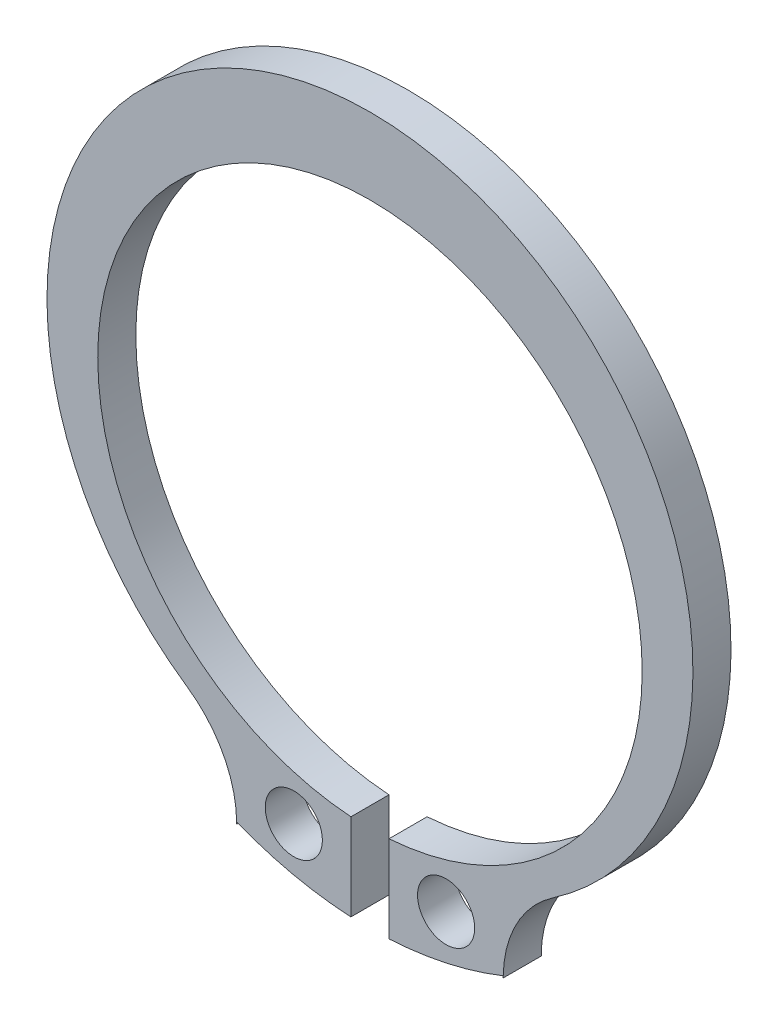
ISO-10303-21;
HEADER;
FILE_DESCRIPTION(('STEP AP214'),'2;1');
FILE_NAME('part.step','',(''),(''),'','','');
FILE_SCHEMA(('AUTOMOTIVE_DESIGN { 1 0 10303 214 1 1 1 1 }'));
ENDSEC;
DATA;
#1=APPLICATION_CONTEXT('core data for automotive mechanical design processes');
#2=APPLICATION_PROTOCOL_DEFINITION('international standard','automotive_design',2000,#1);
#3=PRODUCT_CONTEXT('',#1,'mechanical');
#4=PRODUCT('Part','Part','',(#3));
#5=PRODUCT_RELATED_PRODUCT_CATEGORY('part','',(#4));
#6=PRODUCT_DEFINITION_FORMATION('','',#4);
#7=PRODUCT_DEFINITION_CONTEXT('part definition',#1,'design');
#8=PRODUCT_DEFINITION('design','',#6,#7);
#9=PRODUCT_DEFINITION_SHAPE('','',#8);
#10=(LENGTH_UNIT() NAMED_UNIT(*) SI_UNIT(.MILLI.,.METRE.));
#11=(NAMED_UNIT(*) PLANE_ANGLE_UNIT() SI_UNIT($,.RADIAN.));
#12=(NAMED_UNIT(*) SI_UNIT($,.STERADIAN.) SOLID_ANGLE_UNIT());
#13=UNCERTAINTY_MEASURE_WITH_UNIT(LENGTH_MEASURE(1.E-05),#10,'distance_accuracy_value','');
#14=(GEOMETRIC_REPRESENTATION_CONTEXT(3) GLOBAL_UNCERTAINTY_ASSIGNED_CONTEXT((#13)) GLOBAL_UNIT_ASSIGNED_CONTEXT((#10,
#11,#12)) REPRESENTATION_CONTEXT('',''));
#15=CARTESIAN_POINT('',(0.,0.,0.));
#16=DIRECTION('',(0.,0.,1.));
#17=DIRECTION('',(1.,0.,0.));
#18=AXIS2_PLACEMENT_3D('',#15,#16,#17);
#19=CARTESIAN_POINT('',(-3.,-1.66745992903,0.));
#20=DIRECTION('',(1.,0.,0.));
#21=DIRECTION('',(0.,0.,-1.));
#22=AXIS2_PLACEMENT_3D('',#19,#20,#21);
#23=PLANE('',#22);
#24=DIRECTION('',(0.,0.,1.));
#25=VECTOR('',#24,1.);
#26=CARTESIAN_POINT('',(-3.,-1.66745992903,0.));
#27=LINE('',#26,#25);
#28=CARTESIAN_POINT('',(-3.,-1.66745992903,1.));
#29=VERTEX_POINT('',#28);
#30=CARTESIAN_POINT('',(-3.,-1.66745992903,0.));
#31=VERTEX_POINT('',#30);
#32=EDGE_CURVE('E82',#29,#31,#27,.F.);
#33=ORIENTED_EDGE('',*,*,#32,.T.);
#34=CARTESIAN_POINT('',(-3.,-1.66745992903,0.));
#35=DIRECTION('',(0.,1.,0.));
#36=VECTOR('',#35,1.);
#37=LINE('',#34,#36);
#38=CARTESIAN_POINT('',(-3.00021364023456,-1.61731204158699,0.));
#39=VERTEX_POINT('',#38);
#40=EDGE_CURVE('E215',#31,#39,#37,.T.);
#41=ORIENTED_EDGE('',*,*,#40,.T.);
#42=DIRECTION('',(0.,0.,1.));
#43=VECTOR('',#42,1.);
#44=CARTESIAN_POINT('',(-3.,-1.61746257169362,1.));
#45=LINE('',#44,#43);
#46=CARTESIAN_POINT('',(-3.00021364023456,-1.61731204158699,1.));
#47=VERTEX_POINT('',#46);
#48=EDGE_CURVE('E213',#47,#39,#45,.F.);
#49=ORIENTED_EDGE('',*,*,#48,.F.);
#50=CARTESIAN_POINT('',(-3.,-1.61731594118,1.));
#51=DIRECTION('',(0.,-1.,0.));
#52=VECTOR('',#51,1.);
#53=LINE('',#50,#52);
#54=EDGE_CURVE('E218',#47,#29,#53,.T.);
#55=ORIENTED_EDGE('',*,*,#54,.T.);
#56=EDGE_LOOP('',(#33,#41,#49,#55));
#57=FACE_BOUND('',#56,.T.);
#58=ADVANCED_FACE('F17',(#57),#23,.T.);
#59=CARTESIAN_POINT('',(4.,-1.61746257169,0.));
#60=DIRECTION('',(-1.,0.,0.));
#61=DIRECTION('',(0.,0.,1.));
#62=AXIS2_PLACEMENT_3D('',#59,#60,#61);
#63=PLANE('',#62);
#64=DIRECTION('',(0.,0.,1.));
#65=VECTOR('',#64,1.);
#66=CARTESIAN_POINT('',(4.,-1.61746257169362,0.));
#67=LINE('',#66,#65);
#68=CARTESIAN_POINT('',(4.00021364023456,-1.61731204158699,0.));
#69=VERTEX_POINT('',#68);
#70=CARTESIAN_POINT('',(4.00021364023456,-1.61731204158699,1.));
#71=VERTEX_POINT('',#70);
#72=EDGE_CURVE('E129',#69,#71,#67,.T.);
#73=ORIENTED_EDGE('',*,*,#72,.F.);
#74=CARTESIAN_POINT('',(4.,-1.61731594118,0.));
#75=DIRECTION('',(0.,-1.,0.));
#76=VECTOR('',#75,1.);
#77=LINE('',#74,#76);
#78=CARTESIAN_POINT('',(4.,-1.66745992903,0.));
#79=VERTEX_POINT('',#78);
#80=EDGE_CURVE('E105',#69,#79,#77,.T.);
#81=ORIENTED_EDGE('',*,*,#80,.T.);
#82=DIRECTION('',(0.,0.,1.));
#83=VECTOR('',#82,1.);
#84=CARTESIAN_POINT('',(4.,-1.66745992903,0.));
#85=LINE('',#84,#83);
#86=CARTESIAN_POINT('',(4.,-1.66745992903,1.));
#87=VERTEX_POINT('',#86);
#88=EDGE_CURVE('E141',#79,#87,#85,.T.);
#89=ORIENTED_EDGE('',*,*,#88,.T.);
#90=CARTESIAN_POINT('',(4.,-1.66745992903,1.));
#91=DIRECTION('',(0.,1.,0.));
#92=VECTOR('',#91,1.);
#93=LINE('',#90,#92);
#94=EDGE_CURVE('E123',#87,#71,#93,.T.);
#95=ORIENTED_EDGE('',*,*,#94,.T.);
#96=EDGE_LOOP('',(#73,#81,#89,#95));
#97=FACE_BOUND('',#96,.T.);
#98=ADVANCED_FACE('F133',(#97),#63,.T.);
#99=CARTESIAN_POINT('',(0.,0.,0.));
#100=DIRECTION('',(0.,0.,1.));
#101=DIRECTION('',(1.,0.,0.));
#102=AXIS2_PLACEMENT_3D('',#99,#100,#101);
#103=PLANE('',#102);
#104=CARTESIAN_POINT('',(2.5,-0.909541558152,0.));
#105=DIRECTION('',(0.,0.,-1.));
#106=DIRECTION('',(-1.,0.,0.));
#107=AXIS2_PLACEMENT_3D('',#104,#105,#106);
#108=CIRCLE('',#107,0.75);
#109=CARTESIAN_POINT('',(1.75,-0.909541558152,0.));
#110=VERTEX_POINT('',#109);
#111=EDGE_CURVE('E192',#110,#110,#108,.F.);
#112=ORIENTED_EDGE('',*,*,#111,.T.);
#113=EDGE_LOOP('',(#112));
#114=FACE_BOUND('',#113,.T.);
#115=CARTESIAN_POINT('',(-1.5,-0.909541558152,0.));
#116=DIRECTION('',(0.,0.,1.));
#117=DIRECTION('',(1.,0.,0.));
#118=AXIS2_PLACEMENT_3D('',#115,#116,#117);
#119=CIRCLE('',#118,0.75);
#120=CARTESIAN_POINT('',(-0.75,-0.909541558152,0.));
#121=VERTEX_POINT('',#120);
#122=EDGE_CURVE('E131',#121,#121,#119,.T.);
#123=ORIENTED_EDGE('',*,*,#122,.T.);
#124=EDGE_LOOP('',(#123));
#125=FACE_BOUND('',#124,.T.);
#126=DIRECTION('',(0.,1.,0.));
#127=VECTOR('',#126,1.);
#128=CARTESIAN_POINT('',(1.,0.,0.));
#129=LINE('',#128,#127);
#130=CARTESIAN_POINT('',(1.,-6.21898366137685E-13,0.));
#131=VERTEX_POINT('',#130);
#132=CARTESIAN_POINT('',(1.00000000000014,-2.27823058891532,0.));
#133=VERTEX_POINT('',#132);
#134=EDGE_CURVE('E137',#131,#133,#129,.F.);
#135=ORIENTED_EDGE('',*,*,#134,.F.);
#136=CARTESIAN_POINT('',(0.5,7.13249605678,0.));
#137=DIRECTION('',(0.,0.,1.));
#138=DIRECTION('',(1.,0.,0.));
#139=AXIS2_PLACEMENT_3D('',#136,#137,#138);
#140=CIRCLE('',#139,7.15);
#141=CARTESIAN_POINT('',(0.,-1.2416283279304E-12,0.));
#142=VERTEX_POINT('',#141);
#143=EDGE_CURVE('E67',#131,#142,#140,.T.);
#144=ORIENTED_EDGE('',*,*,#143,.T.);
#145=DIRECTION('',(0.,1.,0.));
#146=VECTOR('',#145,1.);
#147=CARTESIAN_POINT('',(0.,-2.27823058891,0.));
#148=LINE('',#147,#146);
#149=CARTESIAN_POINT('',(0.,-2.27823058891266,0.));
#150=VERTEX_POINT('',#149);
#151=EDGE_CURVE('E210',#150,#142,#148,.T.);
#152=ORIENTED_EDGE('',*,*,#151,.F.);
#153=CARTESIAN_POINT('',(0.5,7.13249605678,0.));
#154=DIRECTION('',(0.,0.,1.));
#155=DIRECTION('',(1.,0.,0.));
#156=AXIS2_PLACEMENT_3D('',#153,#154,#155);
#157=CIRCLE('',#156,9.424);
#158=EDGE_CURVE('E74',#39,#150,#157,.T.);
#159=ORIENTED_EDGE('',*,*,#158,.F.);
#160=CARTESIAN_POINT('',(-3.00043382927,-1.61731594118,0.));
#161=CARTESIAN_POINT('',(-3.00594819159302,-1.25999100097546,0.));
#162=CARTESIAN_POINT('',(-3.09690293039279,-0.911277415092166,0.));
#163=CARTESIAN_POINT('',(-3.18770674112396,-0.563142476002942,0.));
#164=CARTESIAN_POINT('',(-3.35711649943729,-0.247883133395772,0.));
#165=CARTESIAN_POINT('',(-3.52703953464853,0.0683313805015504,0.));
#166=CARTESIAN_POINT('',(-3.76652038983473,0.335375663818824,0.));
#167=CARTESIAN_POINT('',(-4.00747674854235,0.604065276071072,0.));
#168=CARTESIAN_POINT('',(-4.30188679245,0.805678064359,0.));
#169=B_SPLINE_CURVE_WITH_KNOTS('',2,(#160,#161,#162,#163,#164,#165,#166,#167,#168),
.UNSPECIFIED.,.F.,.F.,(3,2,2,2,3),(0.,0.25,0.5,0.75,1.),.UNSPECIFIED.);
#170=CARTESIAN_POINT('',(-4.30188679244961,0.80567806435958,0.));
#171=VERTEX_POINT('',#170);
#172=EDGE_CURVE('E277',#39,#171,#169,.T.);
#173=ORIENTED_EDGE('',*,*,#172,.T.);
#174=CARTESIAN_POINT('',(0.5,7.79916272345,0.));
#175=DIRECTION('',(0.,0.,1.));
#176=DIRECTION('',(0.566037735848713,-0.824379331130556,0.));
#177=AXIS2_PLACEMENT_3D('',#174,#175,#176);
#178=CIRCLE('',#177,8.48333333333);
#179=CARTESIAN_POINT('',(5.30188679244921,0.805678064360149,0.));
#180=VERTEX_POINT('',#179);
#181=EDGE_CURVE('E117',#180,#171,#178,.T.);
#182=ORIENTED_EDGE('',*,*,#181,.F.);
#183=CARTESIAN_POINT('',(5.30188679245,0.805678064359,0.));
#184=CARTESIAN_POINT('',(5.00702099750542,0.603753176537707,0.));
#185=CARTESIAN_POINT('',(4.76652038983594,0.335375663820208,0.));
#186=CARTESIAN_POINT('',(4.52640715971024,0.0674304303500997,0.));
#187=CARTESIAN_POINT('',(4.3571164994373,-0.247883133395758,0.));
#188=CARTESIAN_POINT('',(4.18730476589033,-0.564167225998587,0.));
#189=CARTESIAN_POINT('',(4.09690293039246,-0.911277415093347,0.));
#190=CARTESIAN_POINT('',(4.00593966868139,-1.26054327677991,0.));
#191=CARTESIAN_POINT('',(4.00043382927,-1.61731594118,0.));
#192=B_SPLINE_CURVE_WITH_KNOTS('',2,(#183,#184,#185,#186,#187,#188,#189,#190,#191),
.UNSPECIFIED.,.F.,.F.,(3,2,2,2,3),(0.,0.25,0.5,0.75,1.),.UNSPECIFIED.);
#193=EDGE_CURVE('E111',#180,#69,#192,.T.);
#194=ORIENTED_EDGE('',*,*,#193,.T.);
#195=CARTESIAN_POINT('',(0.5,7.13249605678,0.));
#196=DIRECTION('',(0.,0.,1.));
#197=DIRECTION('',(1.,0.,0.));
#198=AXIS2_PLACEMENT_3D('',#195,#196,#197);
#199=CIRCLE('',#198,9.424);
#200=EDGE_CURVE('E115',#133,#69,#199,.T.);
#201=ORIENTED_EDGE('',*,*,#200,.F.);
#202=EDGE_LOOP('',(#135,#144,#152,#159,#173,#182,#194,#201));
#203=FACE_BOUND('',#202,.T.);
#204=ADVANCED_FACE('F114',(#114,#125,#203),#103,.F.);
#205=CARTESIAN_POINT('',(7.,-1.66745992903,0.));
#206=DIRECTION('',(0.,0.,1.));
#207=DIRECTION('',(1.,0.,0.));
#208=AXIS2_PLACEMENT_3D('',#205,#206,#207);
#209=CYLINDRICAL_SURFACE('',#208,3.);
#210=DIRECTION('',(0.,0.,1.));
#211=VECTOR('',#210,1.);
#212=CARTESIAN_POINT('',(5.30188679244803,0.805678064361867,0.));
#213=LINE('',#212,#211);
#214=CARTESIAN_POINT('',(5.30188679244946,0.805678064362849,1.));
#215=VERTEX_POINT('',#214);
#216=EDGE_CURVE('E122',#215,#180,#213,.F.);
#217=ORIENTED_EDGE('',*,*,#216,.F.);
#218=CARTESIAN_POINT('',(7.,-1.66745992903,1.));
#219=DIRECTION('',(0.,0.,1.));
#220=DIRECTION('',(1.,0.,0.));
#221=AXIS2_PLACEMENT_3D('',#218,#219,#220);
#222=CIRCLE('',#221,3.);
#223=EDGE_CURVE('E187',#71,#215,#222,.F.);
#224=ORIENTED_EDGE('',*,*,#223,.F.);
#225=ORIENTED_EDGE('',*,*,#94,.F.);
#226=ORIENTED_EDGE('',*,*,#88,.F.);
#227=ORIENTED_EDGE('',*,*,#80,.F.);
#228=ORIENTED_EDGE('',*,*,#193,.F.);
#229=EDGE_LOOP('',(#217,#224,#225,#226,#227,#228));
#230=FACE_BOUND('',#229,.T.);
#231=ADVANCED_FACE('F140',(#230),#209,.F.);
#232=CARTESIAN_POINT('',(0.5,7.79916272345,0.));
#233=DIRECTION('',(0.,0.,1.));
#234=DIRECTION('',(1.,0.,0.));
#235=AXIS2_PLACEMENT_3D('',#232,#233,#234);
#236=CYLINDRICAL_SURFACE('',#235,8.48333333333);
#237=ORIENTED_EDGE('',*,*,#216,.T.);
#238=ORIENTED_EDGE('',*,*,#181,.T.);
#239=DIRECTION('',(0.,0.,1.));
#240=VECTOR('',#239,1.);
#241=CARTESIAN_POINT('',(-4.30188679244999,0.805678064359012,0.));
#242=LINE('',#241,#240);
#243=CARTESIAN_POINT('',(-4.30188679245142,0.805678064359993,1.));
#244=VERTEX_POINT('',#243);
#245=EDGE_CURVE('E220',#171,#244,#242,.T.);
#246=ORIENTED_EDGE('',*,*,#245,.T.);
#247=CARTESIAN_POINT('',(0.5,7.79916272345,1.));
#248=DIRECTION('',(0.,0.,1.));
#249=DIRECTION('',(1.,0.,0.));
#250=AXIS2_PLACEMENT_3D('',#247,#248,#249);
#251=CIRCLE('',#250,8.48333333333);
#252=EDGE_CURVE('E191',#215,#244,#251,.T.);
#253=ORIENTED_EDGE('',*,*,#252,.F.);
#254=EDGE_LOOP('',(#237,#238,#246,#253));
#255=FACE_BOUND('',#254,.T.);
#256=ADVANCED_FACE('F159',(#255),#236,.T.);
#257=CARTESIAN_POINT('',(-6.,-1.66745992903,0.));
#258=DIRECTION('',(0.,0.,1.));
#259=DIRECTION('',(1.,0.,0.));
#260=AXIS2_PLACEMENT_3D('',#257,#258,#259);
#261=CYLINDRICAL_SURFACE('',#260,3.);
#262=ORIENTED_EDGE('',*,*,#32,.F.);
#263=ORIENTED_EDGE('',*,*,#54,.F.);
#264=CARTESIAN_POINT('',(-6.,-1.66745992903,1.));
#265=DIRECTION('',(0.,0.,1.));
#266=DIRECTION('',(1.,0.,0.));
#267=AXIS2_PLACEMENT_3D('',#264,#265,#266);
#268=CIRCLE('',#267,3.);
#269=EDGE_CURVE('E194',#244,#47,#268,.F.);
#270=ORIENTED_EDGE('',*,*,#269,.F.);
#271=ORIENTED_EDGE('',*,*,#245,.F.);
#272=ORIENTED_EDGE('',*,*,#172,.F.);
#273=ORIENTED_EDGE('',*,*,#40,.F.);
#274=EDGE_LOOP('',(#262,#263,#270,#271,#272,#273));
#275=FACE_BOUND('',#274,.T.);
#276=ADVANCED_FACE('F244',(#275),#261,.F.);
#277=CARTESIAN_POINT('',(0.5,7.13249605678,0.));
#278=DIRECTION('',(0.,0.,1.));
#279=DIRECTION('',(1.,0.,0.));
#280=AXIS2_PLACEMENT_3D('',#277,#278,#279);
#281=CYLINDRICAL_SURFACE('',#280,9.424);
#282=ORIENTED_EDGE('',*,*,#48,.T.);
#283=ORIENTED_EDGE('',*,*,#158,.T.);
#284=DIRECTION('',(0.,0.,-1.));
#285=VECTOR('',#284,1.);
#286=CARTESIAN_POINT('',(0.,-2.27823058891,0.));
#287=LINE('',#286,#285);
#288=CARTESIAN_POINT('',(0.,-2.27823058891266,1.));
#289=VERTEX_POINT('',#288);
#290=EDGE_CURVE('E212',#289,#150,#287,.T.);
#291=ORIENTED_EDGE('',*,*,#290,.F.);
#292=CARTESIAN_POINT('',(0.5,7.13249605678,1.));
#293=DIRECTION('',(0.,0.,1.));
#294=DIRECTION('',(1.,0.,0.));
#295=AXIS2_PLACEMENT_3D('',#292,#293,#294);
#296=CIRCLE('',#295,9.424);
#297=EDGE_CURVE('E296',#47,#289,#296,.T.);
#298=ORIENTED_EDGE('',*,*,#297,.F.);
#299=EDGE_LOOP('',(#282,#283,#291,#298));
#300=FACE_BOUND('',#299,.T.);
#301=ADVANCED_FACE('F253',(#300),#281,.T.);
#302=CARTESIAN_POINT('',(0.,-2.27823058891,0.));
#303=DIRECTION('',(1.,0.,0.));
#304=DIRECTION('',(0.,0.,-1.));
#305=AXIS2_PLACEMENT_3D('',#302,#303,#304);
#306=PLANE('',#305);
#307=ORIENTED_EDGE('',*,*,#290,.T.);
#308=ORIENTED_EDGE('',*,*,#151,.T.);
#309=DIRECTION('',(0.,0.,1.));
#310=VECTOR('',#309,1.);
#311=CARTESIAN_POINT('',(0.,-1.23859256184744E-12,0.));
#312=LINE('',#311,#310);
#313=CARTESIAN_POINT('',(0.,-1.2416283279304E-12,1.));
#314=VERTEX_POINT('',#313);
#315=EDGE_CURVE('E209',#142,#314,#312,.T.);
#316=ORIENTED_EDGE('',*,*,#315,.T.);
#317=DIRECTION('',(0.,1.,0.));
#318=VECTOR('',#317,1.);
#319=CARTESIAN_POINT('',(0.,0.,1.));
#320=LINE('',#319,#318);
#321=EDGE_CURVE('E292',#289,#314,#320,.T.);
#322=ORIENTED_EDGE('',*,*,#321,.F.);
#323=EDGE_LOOP('',(#307,#308,#316,#322));
#324=FACE_BOUND('',#323,.T.);
#325=ADVANCED_FACE('F315',(#324),#306,.T.);
#326=CARTESIAN_POINT('',(0.5,7.13249605678,0.));
#327=DIRECTION('',(0.,0.,1.));
#328=DIRECTION('',(1.,0.,0.));
#329=AXIS2_PLACEMENT_3D('',#326,#327,#328);
#330=CYLINDRICAL_SURFACE('',#329,7.15);
#331=CARTESIAN_POINT('',(0.5,7.13249605678,1.));
#332=DIRECTION('',(0.,0.,1.));
#333=DIRECTION('',(1.,0.,0.));
#334=AXIS2_PLACEMENT_3D('',#331,#332,#333);
#335=CIRCLE('',#334,7.15);
#336=CARTESIAN_POINT('',(1.,-6.21898366137685E-13,1.));
#337=VERTEX_POINT('',#336);
#338=EDGE_CURVE('E295',#314,#337,#335,.F.);
#339=ORIENTED_EDGE('',*,*,#338,.F.);
#340=ORIENTED_EDGE('',*,*,#315,.F.);
#341=ORIENTED_EDGE('',*,*,#143,.F.);
#342=DIRECTION('',(0.,0.,1.));
#343=VECTOR('',#342,1.);
#344=CARTESIAN_POINT('',(1.,0.,0.));
#345=LINE('',#344,#343);
#346=EDGE_CURVE('E288',#337,#131,#345,.F.);
#347=ORIENTED_EDGE('',*,*,#346,.F.);
#348=EDGE_LOOP('',(#339,#340,#341,#347));
#349=FACE_BOUND('',#348,.T.);
#350=ADVANCED_FACE('F318',(#349),#330,.F.);
#351=CARTESIAN_POINT('',(1.,0.,0.));
#352=DIRECTION('',(-1.,0.,0.));
#353=DIRECTION('',(0.,0.,1.));
#354=AXIS2_PLACEMENT_3D('',#351,#352,#353);
#355=PLANE('',#354);
#356=ORIENTED_EDGE('',*,*,#346,.T.);
#357=ORIENTED_EDGE('',*,*,#134,.T.);
#358=DIRECTION('',(0.,0.,1.));
#359=VECTOR('',#358,1.);
#360=CARTESIAN_POINT('',(1.00000000000028,-2.27823058891531,0.));
#361=LINE('',#360,#359);
#362=CARTESIAN_POINT('',(1.00000000000014,-2.27823058891532,1.));
#363=VERTEX_POINT('',#362);
#364=EDGE_CURVE('E36',#363,#133,#361,.F.);
#365=ORIENTED_EDGE('',*,*,#364,.F.);
#366=DIRECTION('',(0.,1.,0.));
#367=VECTOR('',#366,1.);
#368=CARTESIAN_POINT('',(1.,0.,1.));
#369=LINE('',#368,#367);
#370=EDGE_CURVE('E297',#337,#363,#369,.F.);
#371=ORIENTED_EDGE('',*,*,#370,.F.);
#372=EDGE_LOOP('',(#356,#357,#365,#371));
#373=FACE_BOUND('',#372,.T.);
#374=ADVANCED_FACE('F319',(#373),#355,.T.);
#375=CARTESIAN_POINT('',(0.5,7.13249605678,0.));
#376=DIRECTION('',(0.,0.,1.));
#377=DIRECTION('',(1.,0.,0.));
#378=AXIS2_PLACEMENT_3D('',#375,#376,#377);
#379=CYLINDRICAL_SURFACE('',#378,9.424);
#380=ORIENTED_EDGE('',*,*,#364,.T.);
#381=ORIENTED_EDGE('',*,*,#200,.T.);
#382=ORIENTED_EDGE('',*,*,#72,.T.);
#383=CARTESIAN_POINT('',(0.5,7.13249605678,1.));
#384=DIRECTION('',(0.,0.,1.));
#385=DIRECTION('',(1.,0.,0.));
#386=AXIS2_PLACEMENT_3D('',#383,#384,#385);
#387=CIRCLE('',#386,9.424);
#388=EDGE_CURVE('E299',#363,#71,#387,.T.);
#389=ORIENTED_EDGE('',*,*,#388,.F.);
#390=EDGE_LOOP('',(#380,#381,#382,#389));
#391=FACE_BOUND('',#390,.T.);
#392=ADVANCED_FACE('F128',(#391),#379,.T.);
#393=CARTESIAN_POINT('',(-1.5,-0.909541558152,1.));
#394=DIRECTION('',(0.,0.,1.));
#395=DIRECTION('',(1.,0.,0.));
#396=AXIS2_PLACEMENT_3D('',#393,#394,#395);
#397=CYLINDRICAL_SURFACE('',#396,0.75);
#398=CARTESIAN_POINT('',(-1.5,-0.909541558152,1.));
#399=DIRECTION('',(0.,0.,1.));
#400=DIRECTION('',(1.,0.,0.));
#401=AXIS2_PLACEMENT_3D('',#398,#399,#400);
#402=CIRCLE('',#401,0.75);
#403=CARTESIAN_POINT('',(-0.75,-0.909541558152,1.));
#404=VERTEX_POINT('',#403);
#405=EDGE_CURVE('E27',#404,#404,#402,.F.);
#406=ORIENTED_EDGE('',*,*,#405,.F.);
#407=EDGE_LOOP('',(#406));
#408=FACE_BOUND('',#407,.T.);
#409=ORIENTED_EDGE('',*,*,#122,.F.);
#410=EDGE_LOOP('',(#409));
#411=FACE_BOUND('',#410,.T.);
#412=ADVANCED_FACE('F327',(#408,#411),#397,.F.);
#413=CARTESIAN_POINT('',(2.5,-0.909541558152,1.));
#414=DIRECTION('',(0.,0.,-1.));
#415=DIRECTION('',(-1.,0.,0.));
#416=AXIS2_PLACEMENT_3D('',#413,#414,#415);
#417=CYLINDRICAL_SURFACE('',#416,0.75);
#418=CARTESIAN_POINT('',(2.5,-0.909541558152,1.));
#419=DIRECTION('',(0.,0.,-1.));
#420=DIRECTION('',(-1.,0.,0.));
#421=AXIS2_PLACEMENT_3D('',#418,#419,#420);
#422=CIRCLE('',#421,0.75);
#423=CARTESIAN_POINT('',(1.75,-0.909541558152,1.));
#424=VERTEX_POINT('',#423);
#425=EDGE_CURVE('E11',#424,#424,#422,.T.);
#426=ORIENTED_EDGE('',*,*,#425,.F.);
#427=EDGE_LOOP('',(#426));
#428=FACE_BOUND('',#427,.T.);
#429=ORIENTED_EDGE('',*,*,#111,.F.);
#430=EDGE_LOOP('',(#429));
#431=FACE_BOUND('',#430,.T.);
#432=ADVANCED_FACE('F331',(#428,#431),#417,.F.);
#433=CARTESIAN_POINT('',(0.,0.,1.));
#434=DIRECTION('',(0.,0.,1.));
#435=DIRECTION('',(1.,0.,0.));
#436=AXIS2_PLACEMENT_3D('',#433,#434,#435);
#437=PLANE('',#436);
#438=ORIENTED_EDGE('',*,*,#425,.T.);
#439=EDGE_LOOP('',(#438));
#440=FACE_BOUND('',#439,.T.);
#441=ORIENTED_EDGE('',*,*,#405,.T.);
#442=EDGE_LOOP('',(#441));
#443=FACE_BOUND('',#442,.T.);
#444=ORIENTED_EDGE('',*,*,#370,.T.);
#445=ORIENTED_EDGE('',*,*,#388,.T.);
#446=ORIENTED_EDGE('',*,*,#223,.T.);
#447=ORIENTED_EDGE('',*,*,#252,.T.);
#448=ORIENTED_EDGE('',*,*,#269,.T.);
#449=ORIENTED_EDGE('',*,*,#297,.T.);
#450=ORIENTED_EDGE('',*,*,#321,.T.);
#451=ORIENTED_EDGE('',*,*,#338,.T.);
#452=EDGE_LOOP('',(#444,#445,#446,#447,#448,#449,#450,#451));
#453=FACE_BOUND('',#452,.T.);
#454=ADVANCED_FACE('F312',(#440,#443,#453),#437,.T.);
#455=CLOSED_SHELL('',(#58,#98,#204,#231,#256,#276,#301,#325,#350,#374,#392,#412,#432,#454));
#456=MANIFOLD_SOLID_BREP('B1',#455);
#457=ADVANCED_BREP_SHAPE_REPRESENTATION('',(#18,#456),#14);
#458=SHAPE_DEFINITION_REPRESENTATION(#9,#457);
ENDSEC;
END-ISO-10303-21;
